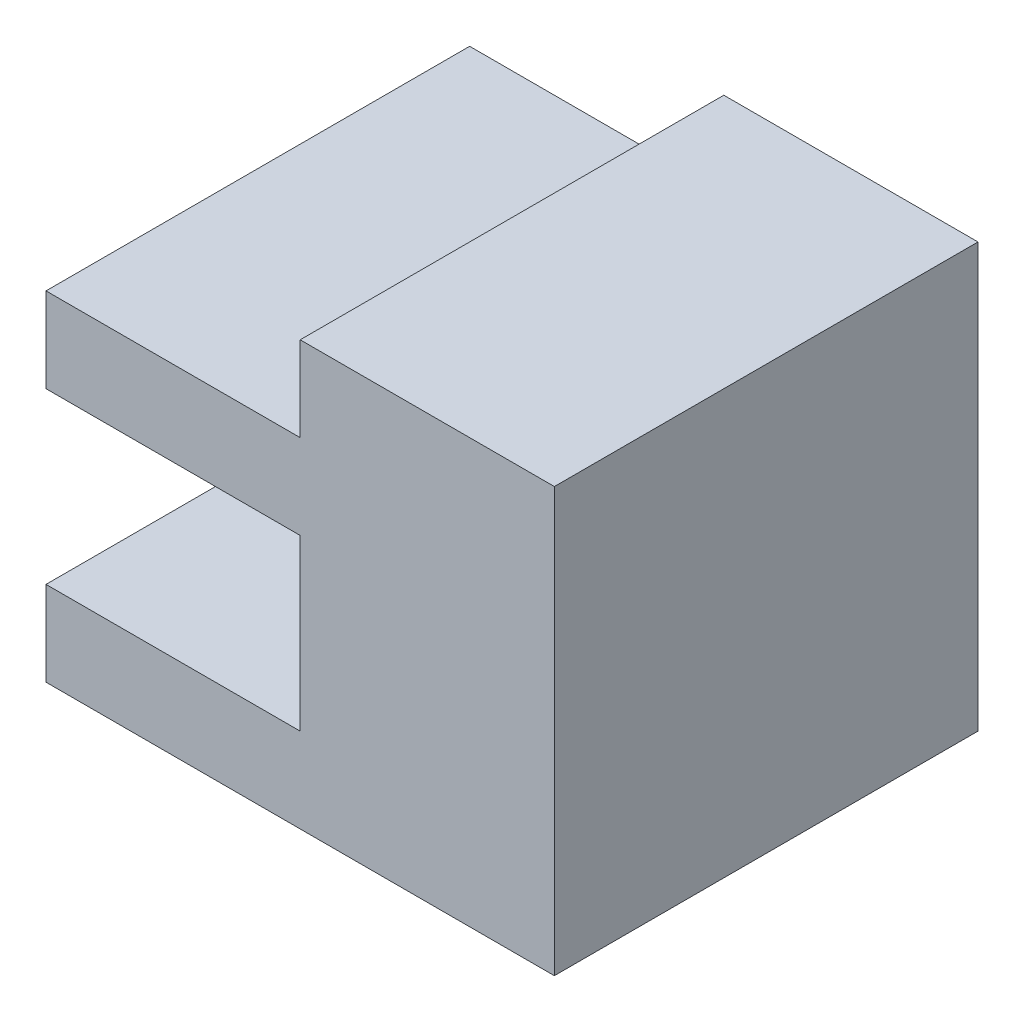
ISO-10303-21;
HEADER;
FILE_DESCRIPTION(('STEP AP214'),'2;1');
FILE_NAME('part.step','',(''),(''),'','','');
FILE_SCHEMA(('AUTOMOTIVE_DESIGN { 1 0 10303 214 1 1 1 1 }'));
ENDSEC;
DATA;
#1=APPLICATION_CONTEXT('core data for automotive mechanical design processes');
#2=APPLICATION_PROTOCOL_DEFINITION('international standard','automotive_design',2000,#1);
#3=PRODUCT_CONTEXT('',#1,'mechanical');
#4=PRODUCT('Part','Part','',(#3));
#5=PRODUCT_RELATED_PRODUCT_CATEGORY('part','',(#4));
#6=PRODUCT_DEFINITION_FORMATION('','',#4);
#7=PRODUCT_DEFINITION_CONTEXT('part definition',#1,'design');
#8=PRODUCT_DEFINITION('design','',#6,#7);
#9=PRODUCT_DEFINITION_SHAPE('','',#8);
#10=(LENGTH_UNIT() NAMED_UNIT(*) SI_UNIT(.MILLI.,.METRE.));
#11=(NAMED_UNIT(*) PLANE_ANGLE_UNIT() SI_UNIT($,.RADIAN.));
#12=(NAMED_UNIT(*) SI_UNIT($,.STERADIAN.) SOLID_ANGLE_UNIT());
#13=UNCERTAINTY_MEASURE_WITH_UNIT(LENGTH_MEASURE(1.E-05),#10,'distance_accuracy_value','');
#14=(GEOMETRIC_REPRESENTATION_CONTEXT(3) GLOBAL_UNCERTAINTY_ASSIGNED_CONTEXT((#13)) GLOBAL_UNIT_ASSIGNED_CONTEXT((#10,
#11,#12)) REPRESENTATION_CONTEXT('',''));
#15=CARTESIAN_POINT('',(0.,0.,0.));
#16=DIRECTION('',(0.,0.,1.));
#17=DIRECTION('',(1.,0.,0.));
#18=AXIS2_PLACEMENT_3D('',#15,#16,#17);
#19=CARTESIAN_POINT('',(-30.,15.,25.));
#20=DIRECTION('',(1.,0.,0.));
#21=DIRECTION('',(0.,0.,-1.));
#22=AXIS2_PLACEMENT_3D('',#19,#20,#21);
#23=PLANE('',#22);
#24=DIRECTION('',(0.,-1.,0.));
#25=VECTOR('',#24,1.);
#26=CARTESIAN_POINT('',(-30.,15.,0.));
#27=LINE('',#26,#25);
#28=CARTESIAN_POINT('',(-30.,20.,0.));
#29=VERTEX_POINT('',#28);
#30=CARTESIAN_POINT('',(-30.,15.,0.));
#31=VERTEX_POINT('',#30);
#32=EDGE_CURVE('E141',#29,#31,#27,.T.);
#33=ORIENTED_EDGE('',*,*,#32,.T.);
#34=DIRECTION('',(0.,0.,-1.));
#35=VECTOR('',#34,1.);
#36=CARTESIAN_POINT('',(-30.,15.,25.));
#37=LINE('',#36,#35);
#38=CARTESIAN_POINT('',(-30.,15.,25.));
#39=VERTEX_POINT('',#38);
#40=EDGE_CURVE('E11',#39,#31,#37,.T.);
#41=ORIENTED_EDGE('',*,*,#40,.F.);
#42=DIRECTION('',(0.,-1.,0.));
#43=VECTOR('',#42,1.);
#44=CARTESIAN_POINT('',(-30.,15.,25.));
#45=LINE('',#44,#43);
#46=CARTESIAN_POINT('',(-30.,20.,25.));
#47=VERTEX_POINT('',#46);
#48=EDGE_CURVE('E159',#47,#39,#45,.T.);
#49=ORIENTED_EDGE('',*,*,#48,.F.);
#50=DIRECTION('',(0.,0.,-1.));
#51=VECTOR('',#50,1.);
#52=CARTESIAN_POINT('',(-30.,20.,25.));
#53=LINE('',#52,#51);
#54=EDGE_CURVE('E137',#47,#29,#53,.T.);
#55=ORIENTED_EDGE('',*,*,#54,.T.);
#56=EDGE_LOOP('',(#33,#41,#49,#55));
#57=FACE_BOUND('',#56,.T.);
#58=ADVANCED_FACE('F33',(#57),#23,.F.);
#59=CARTESIAN_POINT('',(-15.,15.,25.));
#60=DIRECTION('',(0.,1.,0.));
#61=DIRECTION('',(0.,0.,1.));
#62=AXIS2_PLACEMENT_3D('',#59,#60,#61);
#63=PLANE('',#62);
#64=DIRECTION('',(1.,0.,0.));
#65=VECTOR('',#64,1.);
#66=CARTESIAN_POINT('',(-15.,15.,0.));
#67=LINE('',#66,#65);
#68=CARTESIAN_POINT('',(-15.,15.,0.));
#69=VERTEX_POINT('',#68);
#70=EDGE_CURVE('E144',#31,#69,#67,.T.);
#71=ORIENTED_EDGE('',*,*,#70,.T.);
#72=DIRECTION('',(0.,0.,-1.));
#73=VECTOR('',#72,1.);
#74=CARTESIAN_POINT('',(-15.,15.,25.));
#75=LINE('',#74,#73);
#76=CARTESIAN_POINT('',(-15.,15.,25.));
#77=VERTEX_POINT('',#76);
#78=EDGE_CURVE('E41',#77,#69,#75,.T.);
#79=ORIENTED_EDGE('',*,*,#78,.F.);
#80=DIRECTION('',(1.,0.,0.));
#81=VECTOR('',#80,1.);
#82=CARTESIAN_POINT('',(-15.,15.,25.));
#83=LINE('',#82,#81);
#84=EDGE_CURVE('E98',#39,#77,#83,.T.);
#85=ORIENTED_EDGE('',*,*,#84,.F.);
#86=ORIENTED_EDGE('',*,*,#40,.T.);
#87=EDGE_LOOP('',(#71,#79,#85,#86));
#88=FACE_BOUND('',#87,.T.);
#89=ADVANCED_FACE('F208',(#88),#63,.F.);
#90=CARTESIAN_POINT('',(-15.,5.,25.));
#91=DIRECTION('',(1.,0.,0.));
#92=DIRECTION('',(0.,0.,-1.));
#93=AXIS2_PLACEMENT_3D('',#90,#91,#92);
#94=PLANE('',#93);
#95=DIRECTION('',(0.,-1.,0.));
#96=VECTOR('',#95,1.);
#97=CARTESIAN_POINT('',(-15.,5.,0.));
#98=LINE('',#97,#96);
#99=CARTESIAN_POINT('',(-15.,5.,0.));
#100=VERTEX_POINT('',#99);
#101=EDGE_CURVE('E146',#69,#100,#98,.T.);
#102=ORIENTED_EDGE('',*,*,#101,.T.);
#103=DIRECTION('',(0.,0.,-1.));
#104=VECTOR('',#103,1.);
#105=CARTESIAN_POINT('',(-15.,5.,25.));
#106=LINE('',#105,#104);
#107=CARTESIAN_POINT('',(-15.,5.,25.));
#108=VERTEX_POINT('',#107);
#109=EDGE_CURVE('E172',#108,#100,#106,.T.);
#110=ORIENTED_EDGE('',*,*,#109,.F.);
#111=DIRECTION('',(0.,-1.,0.));
#112=VECTOR('',#111,1.);
#113=CARTESIAN_POINT('',(-15.,5.,25.));
#114=LINE('',#113,#112);
#115=EDGE_CURVE('E180',#77,#108,#114,.T.);
#116=ORIENTED_EDGE('',*,*,#115,.F.);
#117=ORIENTED_EDGE('',*,*,#78,.T.);
#118=EDGE_LOOP('',(#102,#110,#116,#117));
#119=FACE_BOUND('',#118,.T.);
#120=ADVANCED_FACE('F178',(#119),#94,.F.);
#121=CARTESIAN_POINT('',(-30.,5.,25.));
#122=DIRECTION('',(0.,-1.,0.));
#123=DIRECTION('',(0.,0.,-1.));
#124=AXIS2_PLACEMENT_3D('',#121,#122,#123);
#125=PLANE('',#124);
#126=DIRECTION('',(-1.,0.,0.));
#127=VECTOR('',#126,1.);
#128=CARTESIAN_POINT('',(-30.,5.,0.));
#129=LINE('',#128,#127);
#130=CARTESIAN_POINT('',(-30.,5.,0.));
#131=VERTEX_POINT('',#130);
#132=EDGE_CURVE('E148',#100,#131,#129,.T.);
#133=ORIENTED_EDGE('',*,*,#132,.T.);
#134=DIRECTION('',(0.,0.,-1.));
#135=VECTOR('',#134,1.);
#136=CARTESIAN_POINT('',(-30.,5.,25.));
#137=LINE('',#136,#135);
#138=CARTESIAN_POINT('',(-30.,5.,25.));
#139=VERTEX_POINT('',#138);
#140=EDGE_CURVE('E169',#139,#131,#137,.T.);
#141=ORIENTED_EDGE('',*,*,#140,.F.);
#142=DIRECTION('',(-1.,0.,0.));
#143=VECTOR('',#142,1.);
#144=CARTESIAN_POINT('',(-30.,5.,25.));
#145=LINE('',#144,#143);
#146=EDGE_CURVE('E198',#108,#139,#145,.T.);
#147=ORIENTED_EDGE('',*,*,#146,.F.);
#148=ORIENTED_EDGE('',*,*,#109,.T.);
#149=EDGE_LOOP('',(#133,#141,#147,#148));
#150=FACE_BOUND('',#149,.T.);
#151=ADVANCED_FACE('F189',(#150),#125,.F.);
#152=CARTESIAN_POINT('',(-30.,0.,25.));
#153=DIRECTION('',(1.,0.,0.));
#154=DIRECTION('',(0.,1.,0.));
#155=AXIS2_PLACEMENT_3D('',#152,#153,#154);
#156=PLANE('',#155);
#157=DIRECTION('',(0.,-1.,0.));
#158=VECTOR('',#157,1.);
#159=CARTESIAN_POINT('',(-30.,0.,0.));
#160=LINE('',#159,#158);
#161=CARTESIAN_POINT('',(-30.,0.,0.));
#162=VERTEX_POINT('',#161);
#163=EDGE_CURVE('E150',#131,#162,#160,.T.);
#164=ORIENTED_EDGE('',*,*,#163,.T.);
#165=DIRECTION('',(0.,0.,-1.));
#166=VECTOR('',#165,1.);
#167=CARTESIAN_POINT('',(-30.,0.,25.));
#168=LINE('',#167,#166);
#169=CARTESIAN_POINT('',(-30.,0.,25.));
#170=VERTEX_POINT('',#169);
#171=EDGE_CURVE('E166',#170,#162,#168,.T.);
#172=ORIENTED_EDGE('',*,*,#171,.F.);
#173=DIRECTION('',(0.,-1.,0.));
#174=VECTOR('',#173,1.);
#175=CARTESIAN_POINT('',(-30.,0.,25.));
#176=LINE('',#175,#174);
#177=EDGE_CURVE('E195',#139,#170,#176,.T.);
#178=ORIENTED_EDGE('',*,*,#177,.F.);
#179=ORIENTED_EDGE('',*,*,#140,.T.);
#180=EDGE_LOOP('',(#164,#172,#178,#179));
#181=FACE_BOUND('',#180,.T.);
#182=ADVANCED_FACE('F193',(#181),#156,.F.);
#183=CARTESIAN_POINT('',(0.,0.,25.));
#184=DIRECTION('',(0.,1.,0.));
#185=DIRECTION('',(-1.,0.,0.));
#186=AXIS2_PLACEMENT_3D('',#183,#184,#185);
#187=PLANE('',#186);
#188=DIRECTION('',(1.,0.,0.));
#189=VECTOR('',#188,1.);
#190=CARTESIAN_POINT('',(0.,0.,0.));
#191=LINE('',#190,#189);
#192=CARTESIAN_POINT('',(0.,0.,0.));
#193=VERTEX_POINT('',#192);
#194=EDGE_CURVE('E152',#162,#193,#191,.T.);
#195=ORIENTED_EDGE('',*,*,#194,.T.);
#196=DIRECTION('',(0.,0.,-1.));
#197=VECTOR('',#196,1.);
#198=CARTESIAN_POINT('',(0.,0.,25.));
#199=LINE('',#198,#197);
#200=CARTESIAN_POINT('',(0.,0.,25.));
#201=VERTEX_POINT('',#200);
#202=EDGE_CURVE('E163',#201,#193,#199,.T.);
#203=ORIENTED_EDGE('',*,*,#202,.F.);
#204=DIRECTION('',(1.,0.,0.));
#205=VECTOR('',#204,1.);
#206=CARTESIAN_POINT('',(0.,0.,25.));
#207=LINE('',#206,#205);
#208=EDGE_CURVE('E197',#170,#201,#207,.T.);
#209=ORIENTED_EDGE('',*,*,#208,.F.);
#210=ORIENTED_EDGE('',*,*,#171,.T.);
#211=EDGE_LOOP('',(#195,#203,#209,#210));
#212=FACE_BOUND('',#211,.T.);
#213=ADVANCED_FACE('F220',(#212),#187,.F.);
#214=CARTESIAN_POINT('',(0.,25.,25.));
#215=DIRECTION('',(-1.,0.,0.));
#216=DIRECTION('',(0.,-1.,0.));
#217=AXIS2_PLACEMENT_3D('',#214,#215,#216);
#218=PLANE('',#217);
#219=DIRECTION('',(0.,1.,0.));
#220=VECTOR('',#219,1.);
#221=CARTESIAN_POINT('',(0.,25.,0.));
#222=LINE('',#221,#220);
#223=CARTESIAN_POINT('',(0.,25.,0.));
#224=VERTEX_POINT('',#223);
#225=EDGE_CURVE('E154',#193,#224,#222,.T.);
#226=ORIENTED_EDGE('',*,*,#225,.T.);
#227=DIRECTION('',(0.,0.,-1.));
#228=VECTOR('',#227,1.);
#229=CARTESIAN_POINT('',(0.,25.,25.));
#230=LINE('',#229,#228);
#231=CARTESIAN_POINT('',(0.,25.,25.));
#232=VERTEX_POINT('',#231);
#233=EDGE_CURVE('E132',#232,#224,#230,.T.);
#234=ORIENTED_EDGE('',*,*,#233,.F.);
#235=DIRECTION('',(0.,1.,0.));
#236=VECTOR('',#235,1.);
#237=CARTESIAN_POINT('',(0.,25.,25.));
#238=LINE('',#237,#236);
#239=EDGE_CURVE('E123',#201,#232,#238,.T.);
#240=ORIENTED_EDGE('',*,*,#239,.F.);
#241=ORIENTED_EDGE('',*,*,#202,.T.);
#242=EDGE_LOOP('',(#226,#234,#240,#241));
#243=FACE_BOUND('',#242,.T.);
#244=ADVANCED_FACE('F223',(#243),#218,.F.);
#245=CARTESIAN_POINT('',(-15.,25.,25.));
#246=DIRECTION('',(0.,-1.,0.));
#247=DIRECTION('',(0.,0.,-1.));
#248=AXIS2_PLACEMENT_3D('',#245,#246,#247);
#249=PLANE('',#248);
#250=DIRECTION('',(-1.,0.,0.));
#251=VECTOR('',#250,1.);
#252=CARTESIAN_POINT('',(-15.,25.,0.));
#253=LINE('',#252,#251);
#254=CARTESIAN_POINT('',(-15.,25.,0.));
#255=VERTEX_POINT('',#254);
#256=EDGE_CURVE('E131',#224,#255,#253,.T.);
#257=ORIENTED_EDGE('',*,*,#256,.T.);
#258=DIRECTION('',(0.,0.,-1.));
#259=VECTOR('',#258,1.);
#260=CARTESIAN_POINT('',(-15.,25.,25.));
#261=LINE('',#260,#259);
#262=CARTESIAN_POINT('',(-15.,25.,25.));
#263=VERTEX_POINT('',#262);
#264=EDGE_CURVE('E128',#263,#255,#261,.T.);
#265=ORIENTED_EDGE('',*,*,#264,.F.);
#266=DIRECTION('',(-1.,0.,0.));
#267=VECTOR('',#266,1.);
#268=CARTESIAN_POINT('',(-15.,25.,25.));
#269=LINE('',#268,#267);
#270=EDGE_CURVE('E117',#232,#263,#269,.T.);
#271=ORIENTED_EDGE('',*,*,#270,.F.);
#272=ORIENTED_EDGE('',*,*,#233,.T.);
#273=EDGE_LOOP('',(#257,#265,#271,#272));
#274=FACE_BOUND('',#273,.T.);
#275=ADVANCED_FACE('F129',(#274),#249,.F.);
#276=CARTESIAN_POINT('',(-15.,20.,25.));
#277=DIRECTION('',(1.,0.,0.));
#278=DIRECTION('',(0.,0.,-1.));
#279=AXIS2_PLACEMENT_3D('',#276,#277,#278);
#280=PLANE('',#279);
#281=DIRECTION('',(0.,-1.,0.));
#282=VECTOR('',#281,1.);
#283=CARTESIAN_POINT('',(-15.,20.,0.));
#284=LINE('',#283,#282);
#285=CARTESIAN_POINT('',(-15.,20.,0.));
#286=VERTEX_POINT('',#285);
#287=EDGE_CURVE('E84',#255,#286,#284,.T.);
#288=ORIENTED_EDGE('',*,*,#287,.T.);
#289=DIRECTION('',(0.,0.,-1.));
#290=VECTOR('',#289,1.);
#291=CARTESIAN_POINT('',(-15.,20.,25.));
#292=LINE('',#291,#290);
#293=CARTESIAN_POINT('',(-15.,20.,25.));
#294=VERTEX_POINT('',#293);
#295=EDGE_CURVE('E133',#294,#286,#292,.T.);
#296=ORIENTED_EDGE('',*,*,#295,.F.);
#297=DIRECTION('',(0.,-1.,0.));
#298=VECTOR('',#297,1.);
#299=CARTESIAN_POINT('',(-15.,20.,25.));
#300=LINE('',#299,#298);
#301=EDGE_CURVE('E121',#263,#294,#300,.T.);
#302=ORIENTED_EDGE('',*,*,#301,.F.);
#303=ORIENTED_EDGE('',*,*,#264,.T.);
#304=EDGE_LOOP('',(#288,#296,#302,#303));
#305=FACE_BOUND('',#304,.T.);
#306=ADVANCED_FACE('F135',(#305),#280,.F.);
#307=CARTESIAN_POINT('',(-30.,20.,25.));
#308=DIRECTION('',(0.,-1.,0.));
#309=DIRECTION('',(0.,0.,-1.));
#310=AXIS2_PLACEMENT_3D('',#307,#308,#309);
#311=PLANE('',#310);
#312=DIRECTION('',(-1.,0.,0.));
#313=VECTOR('',#312,1.);
#314=CARTESIAN_POINT('',(-30.,20.,0.));
#315=LINE('',#314,#313);
#316=EDGE_CURVE('E90',#286,#29,#315,.T.);
#317=ORIENTED_EDGE('',*,*,#316,.T.);
#318=ORIENTED_EDGE('',*,*,#54,.F.);
#319=DIRECTION('',(-1.,0.,0.));
#320=VECTOR('',#319,1.);
#321=CARTESIAN_POINT('',(-30.,20.,25.));
#322=LINE('',#321,#320);
#323=EDGE_CURVE('E49',#294,#47,#322,.T.);
#324=ORIENTED_EDGE('',*,*,#323,.F.);
#325=ORIENTED_EDGE('',*,*,#295,.T.);
#326=EDGE_LOOP('',(#317,#318,#324,#325));
#327=FACE_BOUND('',#326,.T.);
#328=ADVANCED_FACE('F232',(#327),#311,.F.);
#329=CARTESIAN_POINT('',(0.,0.,25.));
#330=DIRECTION('',(0.,0.,-1.));
#331=DIRECTION('',(-1.,0.,0.));
#332=AXIS2_PLACEMENT_3D('',#329,#330,#331);
#333=PLANE('',#332);
#334=ORIENTED_EDGE('',*,*,#48,.T.);
#335=ORIENTED_EDGE('',*,*,#84,.T.);
#336=ORIENTED_EDGE('',*,*,#115,.T.);
#337=ORIENTED_EDGE('',*,*,#146,.T.);
#338=ORIENTED_EDGE('',*,*,#177,.T.);
#339=ORIENTED_EDGE('',*,*,#208,.T.);
#340=ORIENTED_EDGE('',*,*,#239,.T.);
#341=ORIENTED_EDGE('',*,*,#270,.T.);
#342=ORIENTED_EDGE('',*,*,#301,.T.);
#343=ORIENTED_EDGE('',*,*,#323,.T.);
#344=EDGE_LOOP('',(#334,#335,#336,#337,#338,#339,#340,#341,#342,#343));
#345=FACE_BOUND('',#344,.T.);
#346=ADVANCED_FACE('F119',(#345),#333,.F.);
#347=CARTESIAN_POINT('',(0.,0.,0.));
#348=DIRECTION('',(0.,0.,-1.));
#349=DIRECTION('',(-1.,0.,0.));
#350=AXIS2_PLACEMENT_3D('',#347,#348,#349);
#351=PLANE('',#350);
#352=ORIENTED_EDGE('',*,*,#32,.F.);
#353=ORIENTED_EDGE('',*,*,#316,.F.);
#354=ORIENTED_EDGE('',*,*,#287,.F.);
#355=ORIENTED_EDGE('',*,*,#256,.F.);
#356=ORIENTED_EDGE('',*,*,#225,.F.);
#357=ORIENTED_EDGE('',*,*,#194,.F.);
#358=ORIENTED_EDGE('',*,*,#163,.F.);
#359=ORIENTED_EDGE('',*,*,#132,.F.);
#360=ORIENTED_EDGE('',*,*,#101,.F.);
#361=ORIENTED_EDGE('',*,*,#70,.F.);
#362=EDGE_LOOP('',(#352,#353,#354,#355,#356,#357,#358,#359,#360,#361));
#363=FACE_BOUND('',#362,.T.);
#364=ADVANCED_FACE('F184',(#363),#351,.T.);
#365=CLOSED_SHELL('',(#58,#89,#120,#151,#182,#213,#244,#275,#306,#328,#346,#364));
#366=MANIFOLD_SOLID_BREP('B2',#365);
#367=ADVANCED_BREP_SHAPE_REPRESENTATION('',(#18,#366),#14);
#368=SHAPE_DEFINITION_REPRESENTATION(#9,#367);
ENDSEC;
END-ISO-10303-21;
